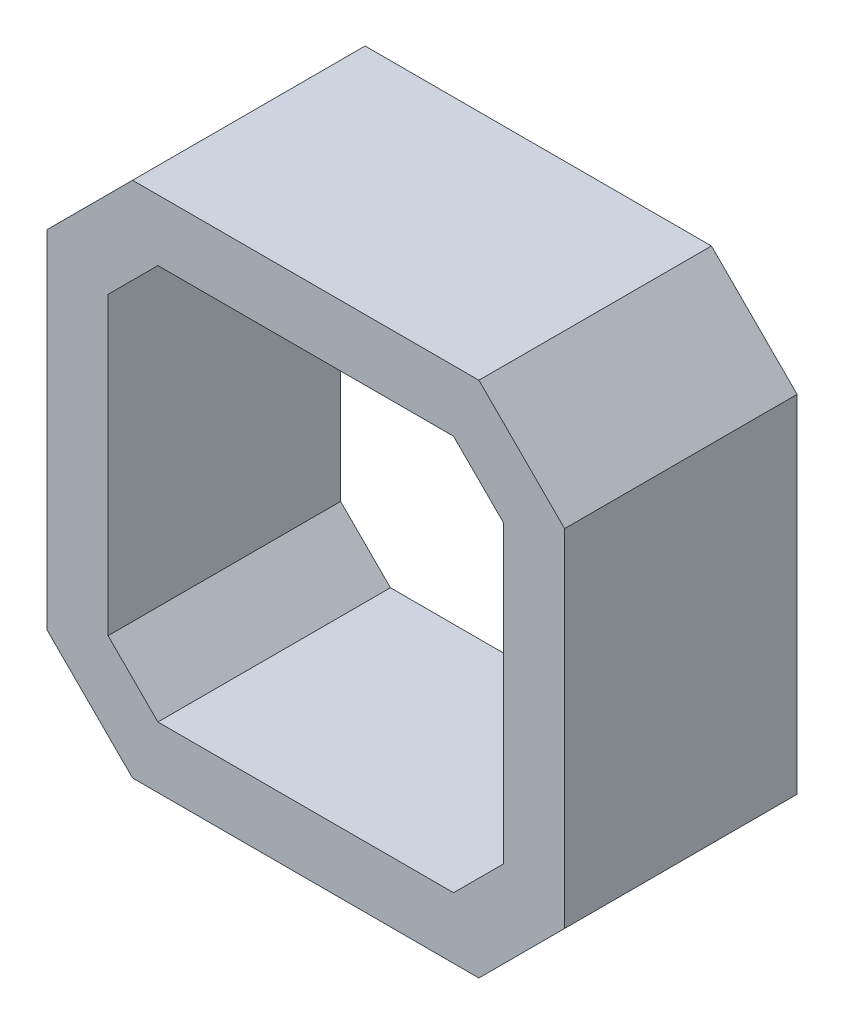
ISO-10303-21;
HEADER;
FILE_DESCRIPTION(('STEP AP214'),'2;1');
FILE_NAME('part.step','',(''),(''),'','','');
FILE_SCHEMA(('AUTOMOTIVE_DESIGN { 1 0 10303 214 1 1 1 1 }'));
ENDSEC;
DATA;
#1=APPLICATION_CONTEXT('core data for automotive mechanical design processes');
#2=APPLICATION_PROTOCOL_DEFINITION('international standard','automotive_design',2000,#1);
#3=PRODUCT_CONTEXT('',#1,'mechanical');
#4=PRODUCT('Part','Part','',(#3));
#5=PRODUCT_RELATED_PRODUCT_CATEGORY('part','',(#4));
#6=PRODUCT_DEFINITION_FORMATION('','',#4);
#7=PRODUCT_DEFINITION_CONTEXT('part definition',#1,'design');
#8=PRODUCT_DEFINITION('design','',#6,#7);
#9=PRODUCT_DEFINITION_SHAPE('','',#8);
#10=(LENGTH_UNIT() NAMED_UNIT(*) SI_UNIT(.MILLI.,.METRE.));
#11=(NAMED_UNIT(*) PLANE_ANGLE_UNIT() SI_UNIT($,.RADIAN.));
#12=(NAMED_UNIT(*) SI_UNIT($,.STERADIAN.) SOLID_ANGLE_UNIT());
#13=UNCERTAINTY_MEASURE_WITH_UNIT(LENGTH_MEASURE(1.E-05),#10,'distance_accuracy_value','');
#14=(GEOMETRIC_REPRESENTATION_CONTEXT(3) GLOBAL_UNCERTAINTY_ASSIGNED_CONTEXT((#13)) GLOBAL_UNIT_ASSIGNED_CONTEXT((#10,
#11,#12)) REPRESENTATION_CONTEXT('',''));
#15=CARTESIAN_POINT('',(0.,0.,0.));
#16=DIRECTION('',(0.,0.,1.));
#17=DIRECTION('',(1.,0.,0.));
#18=AXIS2_PLACEMENT_3D('',#15,#16,#17);
#19=CARTESIAN_POINT('',(0.,0.,19.));
#20=DIRECTION('',(0.,0.,-1.));
#21=DIRECTION('',(-1.,0.,0.));
#22=AXIS2_PLACEMENT_3D('',#19,#20,#21);
#23=PLANE('',#22);
#24=DIRECTION('',(0.,-1.,0.));
#25=VECTOR('',#24,1.);
#26=CARTESIAN_POINT('',(-21.15,-14.15,19.));
#27=LINE('',#26,#25);
#28=CARTESIAN_POINT('',(-21.15,14.15,19.));
#29=VERTEX_POINT('',#28);
#30=CARTESIAN_POINT('',(-21.15,-14.15,19.));
#31=VERTEX_POINT('',#30);
#32=EDGE_CURVE('E242',#29,#31,#27,.T.);
#33=ORIENTED_EDGE('',*,*,#32,.T.);
#34=DIRECTION('',(0.707106781186547,-0.707106781186547,0.));
#35=VECTOR('',#34,1.);
#36=CARTESIAN_POINT('',(-21.15,-14.15,19.));
#37=LINE('',#36,#35);
#38=CARTESIAN_POINT('',(-14.15,-21.15,19.));
#39=VERTEX_POINT('',#38);
#40=EDGE_CURVE('E246',#31,#39,#37,.T.);
#41=ORIENTED_EDGE('',*,*,#40,.T.);
#42=DIRECTION('',(1.,0.,0.));
#43=VECTOR('',#42,1.);
#44=CARTESIAN_POINT('',(-14.15,-21.15,19.));
#45=LINE('',#44,#43);
#46=CARTESIAN_POINT('',(14.15,-21.15,19.));
#47=VERTEX_POINT('',#46);
#48=EDGE_CURVE('E250',#39,#47,#45,.T.);
#49=ORIENTED_EDGE('',*,*,#48,.T.);
#50=DIRECTION('',(0.707106781186547,0.707106781186547,0.));
#51=VECTOR('',#50,1.);
#52=CARTESIAN_POINT('',(14.15,-21.15,19.));
#53=LINE('',#52,#51);
#54=CARTESIAN_POINT('',(21.15,-14.15,19.));
#55=VERTEX_POINT('',#54);
#56=EDGE_CURVE('E253',#47,#55,#53,.T.);
#57=ORIENTED_EDGE('',*,*,#56,.T.);
#58=DIRECTION('',(0.,1.,0.));
#59=VECTOR('',#58,1.);
#60=CARTESIAN_POINT('',(21.15,-14.15,19.));
#61=LINE('',#60,#59);
#62=CARTESIAN_POINT('',(21.15,14.15,19.));
#63=VERTEX_POINT('',#62);
#64=EDGE_CURVE('E256',#55,#63,#61,.T.);
#65=ORIENTED_EDGE('',*,*,#64,.T.);
#66=DIRECTION('',(-0.707106781186547,0.707106781186547,0.));
#67=VECTOR('',#66,1.);
#68=CARTESIAN_POINT('',(14.15,21.15,19.));
#69=LINE('',#68,#67);
#70=CARTESIAN_POINT('',(14.15,21.15,19.));
#71=VERTEX_POINT('',#70);
#72=EDGE_CURVE('E259',#63,#71,#69,.T.);
#73=ORIENTED_EDGE('',*,*,#72,.T.);
#74=DIRECTION('',(-1.,0.,0.));
#75=VECTOR('',#74,1.);
#76=CARTESIAN_POINT('',(-14.15,21.15,19.));
#77=LINE('',#76,#75);
#78=CARTESIAN_POINT('',(-14.15,21.15,19.));
#79=VERTEX_POINT('',#78);
#80=EDGE_CURVE('E262',#71,#79,#77,.T.);
#81=ORIENTED_EDGE('',*,*,#80,.T.);
#82=DIRECTION('',(-0.707106781186547,-0.707106781186547,0.));
#83=VECTOR('',#82,1.);
#84=CARTESIAN_POINT('',(-21.15,14.15,19.));
#85=LINE('',#84,#83);
#86=EDGE_CURVE('E265',#79,#29,#85,.T.);
#87=ORIENTED_EDGE('',*,*,#86,.T.);
#88=EDGE_LOOP('',(#33,#41,#49,#57,#65,#73,#81,#87));
#89=FACE_BOUND('',#88,.T.);
#90=DIRECTION('',(-0.707106781186547,-0.707106781186547,0.));
#91=VECTOR('',#90,1.);
#92=CARTESIAN_POINT('',(-16.15,12.0789321881345,19.));
#93=LINE('',#92,#91);
#94=CARTESIAN_POINT('',(-12.0789321881345,16.15,19.));
#95=VERTEX_POINT('',#94);
#96=CARTESIAN_POINT('',(-16.15,12.0789321881345,19.));
#97=VERTEX_POINT('',#96);
#98=EDGE_CURVE('E153',#95,#97,#93,.T.);
#99=ORIENTED_EDGE('',*,*,#98,.F.);
#100=DIRECTION('',(-1.,0.,0.));
#101=VECTOR('',#100,1.);
#102=CARTESIAN_POINT('',(-12.0789321881345,16.15,19.));
#103=LINE('',#102,#101);
#104=CARTESIAN_POINT('',(12.0789321881345,16.15,19.));
#105=VERTEX_POINT('',#104);
#106=EDGE_CURVE('E194',#105,#95,#103,.T.);
#107=ORIENTED_EDGE('',*,*,#106,.F.);
#108=DIRECTION('',(-0.707106781186547,0.707106781186547,0.));
#109=VECTOR('',#108,1.);
#110=CARTESIAN_POINT('',(12.0789321881345,16.15,19.));
#111=LINE('',#110,#109);
#112=CARTESIAN_POINT('',(16.15,12.0789321881345,19.));
#113=VERTEX_POINT('',#112);
#114=EDGE_CURVE('E191',#113,#105,#111,.T.);
#115=ORIENTED_EDGE('',*,*,#114,.F.);
#116=DIRECTION('',(0.,1.,0.));
#117=VECTOR('',#116,1.);
#118=CARTESIAN_POINT('',(16.15,-12.0789321881345,19.));
#119=LINE('',#118,#117);
#120=CARTESIAN_POINT('',(16.15,-12.0789321881345,19.));
#121=VERTEX_POINT('',#120);
#122=EDGE_CURVE('E188',#121,#113,#119,.T.);
#123=ORIENTED_EDGE('',*,*,#122,.F.);
#124=DIRECTION('',(0.707106781186547,0.707106781186547,0.));
#125=VECTOR('',#124,1.);
#126=CARTESIAN_POINT('',(12.0789321881345,-16.15,19.));
#127=LINE('',#126,#125);
#128=CARTESIAN_POINT('',(12.0789321881345,-16.15,19.));
#129=VERTEX_POINT('',#128);
#130=EDGE_CURVE('E185',#129,#121,#127,.T.);
#131=ORIENTED_EDGE('',*,*,#130,.F.);
#132=DIRECTION('',(1.,0.,0.));
#133=VECTOR('',#132,1.);
#134=CARTESIAN_POINT('',(-12.0789321881345,-16.15,19.));
#135=LINE('',#134,#133);
#136=CARTESIAN_POINT('',(-12.0789321881345,-16.15,19.));
#137=VERTEX_POINT('',#136);
#138=EDGE_CURVE('E180',#137,#129,#135,.T.);
#139=ORIENTED_EDGE('',*,*,#138,.F.);
#140=DIRECTION('',(0.707106781186547,-0.707106781186547,0.));
#141=VECTOR('',#140,1.);
#142=CARTESIAN_POINT('',(-16.15,-12.0789321881345,19.));
#143=LINE('',#142,#141);
#144=CARTESIAN_POINT('',(-16.15,-12.0789321881345,19.));
#145=VERTEX_POINT('',#144);
#146=EDGE_CURVE('E176',#145,#137,#143,.T.);
#147=ORIENTED_EDGE('',*,*,#146,.F.);
#148=DIRECTION('',(0.,-1.,0.));
#149=VECTOR('',#148,1.);
#150=CARTESIAN_POINT('',(-16.15,-12.0789321881345,19.));
#151=LINE('',#150,#149);
#152=EDGE_CURVE('E162',#97,#145,#151,.T.);
#153=ORIENTED_EDGE('',*,*,#152,.F.);
#154=EDGE_LOOP('',(#99,#107,#115,#123,#131,#139,#147,#153));
#155=FACE_BOUND('',#154,.T.);
#156=ADVANCED_FACE('F39',(#89,#155),#23,.F.);
#157=CARTESIAN_POINT('',(0.,0.,0.));
#158=DIRECTION('',(0.,0.,-1.));
#159=DIRECTION('',(-1.,0.,0.));
#160=AXIS2_PLACEMENT_3D('',#157,#158,#159);
#161=PLANE('',#160);
#162=DIRECTION('',(0.,-1.,0.));
#163=VECTOR('',#162,1.);
#164=CARTESIAN_POINT('',(-21.15,-14.15,0.));
#165=LINE('',#164,#163);
#166=CARTESIAN_POINT('',(-21.15,14.15,0.));
#167=VERTEX_POINT('',#166);
#168=CARTESIAN_POINT('',(-21.15,-14.15,0.));
#169=VERTEX_POINT('',#168);
#170=EDGE_CURVE('E171',#167,#169,#165,.T.);
#171=ORIENTED_EDGE('',*,*,#170,.F.);
#172=DIRECTION('',(-0.707106781186547,-0.707106781186547,0.));
#173=VECTOR('',#172,1.);
#174=CARTESIAN_POINT('',(-21.15,14.15,0.));
#175=LINE('',#174,#173);
#176=CARTESIAN_POINT('',(-14.15,21.15,0.));
#177=VERTEX_POINT('',#176);
#178=EDGE_CURVE('E247',#177,#167,#175,.T.);
#179=ORIENTED_EDGE('',*,*,#178,.F.);
#180=DIRECTION('',(-1.,0.,0.));
#181=VECTOR('',#180,1.);
#182=CARTESIAN_POINT('',(-14.15,21.15,0.));
#183=LINE('',#182,#181);
#184=CARTESIAN_POINT('',(14.15,21.15,0.));
#185=VERTEX_POINT('',#184);
#186=EDGE_CURVE('E287',#185,#177,#183,.T.);
#187=ORIENTED_EDGE('',*,*,#186,.F.);
#188=DIRECTION('',(-0.707106781186547,0.707106781186547,0.));
#189=VECTOR('',#188,1.);
#190=CARTESIAN_POINT('',(14.15,21.15,0.));
#191=LINE('',#190,#189);
#192=CARTESIAN_POINT('',(21.15,14.15,0.));
#193=VERTEX_POINT('',#192);
#194=EDGE_CURVE('E284',#193,#185,#191,.T.);
#195=ORIENTED_EDGE('',*,*,#194,.F.);
#196=DIRECTION('',(0.,1.,0.));
#197=VECTOR('',#196,1.);
#198=CARTESIAN_POINT('',(21.15,-14.15,0.));
#199=LINE('',#198,#197);
#200=CARTESIAN_POINT('',(21.15,-14.15,0.));
#201=VERTEX_POINT('',#200);
#202=EDGE_CURVE('E281',#201,#193,#199,.T.);
#203=ORIENTED_EDGE('',*,*,#202,.F.);
#204=DIRECTION('',(0.707106781186547,0.707106781186547,0.));
#205=VECTOR('',#204,1.);
#206=CARTESIAN_POINT('',(14.15,-21.15,0.));
#207=LINE('',#206,#205);
#208=CARTESIAN_POINT('',(14.15,-21.15,0.));
#209=VERTEX_POINT('',#208);
#210=EDGE_CURVE('E278',#209,#201,#207,.T.);
#211=ORIENTED_EDGE('',*,*,#210,.F.);
#212=DIRECTION('',(1.,0.,0.));
#213=VECTOR('',#212,1.);
#214=CARTESIAN_POINT('',(-14.15,-21.15,0.));
#215=LINE('',#214,#213);
#216=CARTESIAN_POINT('',(-14.15,-21.15,0.));
#217=VERTEX_POINT('',#216);
#218=EDGE_CURVE('E275',#217,#209,#215,.T.);
#219=ORIENTED_EDGE('',*,*,#218,.F.);
#220=DIRECTION('',(0.707106781186547,-0.707106781186547,0.));
#221=VECTOR('',#220,1.);
#222=CARTESIAN_POINT('',(-21.15,-14.15,0.));
#223=LINE('',#222,#221);
#224=EDGE_CURVE('E272',#169,#217,#223,.T.);
#225=ORIENTED_EDGE('',*,*,#224,.F.);
#226=EDGE_LOOP('',(#171,#179,#187,#195,#203,#211,#219,#225));
#227=FACE_BOUND('',#226,.T.);
#228=DIRECTION('',(-1.,0.,0.));
#229=VECTOR('',#228,1.);
#230=CARTESIAN_POINT('',(-12.0789321881345,16.15,0.));
#231=LINE('',#230,#229);
#232=CARTESIAN_POINT('',(12.0789321881345,16.15,0.));
#233=VERTEX_POINT('',#232);
#234=CARTESIAN_POINT('',(-12.0789321881345,16.15,0.));
#235=VERTEX_POINT('',#234);
#236=EDGE_CURVE('E163',#233,#235,#231,.T.);
#237=ORIENTED_EDGE('',*,*,#236,.T.);
#238=DIRECTION('',(-0.707106781186547,-0.707106781186547,0.));
#239=VECTOR('',#238,1.);
#240=CARTESIAN_POINT('',(-16.15,12.0789321881345,0.));
#241=LINE('',#240,#239);
#242=CARTESIAN_POINT('',(-16.15,12.0789321881345,0.));
#243=VERTEX_POINT('',#242);
#244=EDGE_CURVE('E63',#235,#243,#241,.T.);
#245=ORIENTED_EDGE('',*,*,#244,.T.);
#246=DIRECTION('',(0.,-1.,0.));
#247=VECTOR('',#246,1.);
#248=CARTESIAN_POINT('',(-16.15,-12.0789321881345,0.));
#249=LINE('',#248,#247);
#250=CARTESIAN_POINT('',(-16.15,-12.0789321881345,0.));
#251=VERTEX_POINT('',#250);
#252=EDGE_CURVE('E169',#243,#251,#249,.T.);
#253=ORIENTED_EDGE('',*,*,#252,.T.);
#254=DIRECTION('',(0.707106781186547,-0.707106781186547,0.));
#255=VECTOR('',#254,1.);
#256=CARTESIAN_POINT('',(-16.15,-12.0789321881345,0.));
#257=LINE('',#256,#255);
#258=CARTESIAN_POINT('',(-12.0789321881345,-16.15,0.));
#259=VERTEX_POINT('',#258);
#260=EDGE_CURVE('E201',#251,#259,#257,.T.);
#261=ORIENTED_EDGE('',*,*,#260,.T.);
#262=DIRECTION('',(1.,0.,0.));
#263=VECTOR('',#262,1.);
#264=CARTESIAN_POINT('',(-12.0789321881345,-16.15,0.));
#265=LINE('',#264,#263);
#266=CARTESIAN_POINT('',(12.0789321881345,-16.15,0.));
#267=VERTEX_POINT('',#266);
#268=EDGE_CURVE('E205',#259,#267,#265,.T.);
#269=ORIENTED_EDGE('',*,*,#268,.T.);
#270=DIRECTION('',(0.707106781186547,0.707106781186547,0.));
#271=VECTOR('',#270,1.);
#272=CARTESIAN_POINT('',(12.0789321881345,-16.15,0.));
#273=LINE('',#272,#271);
#274=CARTESIAN_POINT('',(16.15,-12.0789321881345,0.));
#275=VERTEX_POINT('',#274);
#276=EDGE_CURVE('E209',#267,#275,#273,.T.);
#277=ORIENTED_EDGE('',*,*,#276,.T.);
#278=DIRECTION('',(0.,1.,0.));
#279=VECTOR('',#278,1.);
#280=CARTESIAN_POINT('',(16.15,-12.0789321881345,0.));
#281=LINE('',#280,#279);
#282=CARTESIAN_POINT('',(16.15,12.0789321881345,0.));
#283=VERTEX_POINT('',#282);
#284=EDGE_CURVE('E213',#275,#283,#281,.T.);
#285=ORIENTED_EDGE('',*,*,#284,.T.);
#286=DIRECTION('',(-0.707106781186547,0.707106781186547,0.));
#287=VECTOR('',#286,1.);
#288=CARTESIAN_POINT('',(12.0789321881345,16.15,0.));
#289=LINE('',#288,#287);
#290=EDGE_CURVE('E217',#283,#233,#289,.T.);
#291=ORIENTED_EDGE('',*,*,#290,.T.);
#292=EDGE_LOOP('',(#237,#245,#253,#261,#269,#277,#285,#291));
#293=FACE_BOUND('',#292,.T.);
#294=ADVANCED_FACE('F326',(#227,#293),#161,.T.);
#295=CARTESIAN_POINT('',(-21.15,-14.15,19.));
#296=DIRECTION('',(1.,0.,0.));
#297=DIRECTION('',(0.,0.,-1.));
#298=AXIS2_PLACEMENT_3D('',#295,#296,#297);
#299=PLANE('',#298);
#300=ORIENTED_EDGE('',*,*,#170,.T.);
#301=DIRECTION('',(0.,0.,-1.));
#302=VECTOR('',#301,1.);
#303=CARTESIAN_POINT('',(-21.15,-14.15,19.));
#304=LINE('',#303,#302);
#305=EDGE_CURVE('E11',#31,#169,#304,.T.);
#306=ORIENTED_EDGE('',*,*,#305,.F.);
#307=ORIENTED_EDGE('',*,*,#32,.F.);
#308=DIRECTION('',(0.,0.,-1.));
#309=VECTOR('',#308,1.);
#310=CARTESIAN_POINT('',(-21.15,14.15,19.));
#311=LINE('',#310,#309);
#312=EDGE_CURVE('E268',#29,#167,#311,.T.);
#313=ORIENTED_EDGE('',*,*,#312,.T.);
#314=EDGE_LOOP('',(#300,#306,#307,#313));
#315=FACE_BOUND('',#314,.T.);
#316=ADVANCED_FACE('F41',(#315),#299,.F.);
#317=CARTESIAN_POINT('',(-21.15,-14.15,19.));
#318=DIRECTION('',(0.707106781186548,0.707106781186548,0.));
#319=DIRECTION('',(-0.707106781186548,0.707106781186548,0.));
#320=AXIS2_PLACEMENT_3D('',#317,#318,#319);
#321=PLANE('',#320);
#322=ORIENTED_EDGE('',*,*,#224,.T.);
#323=DIRECTION('',(0.,0.,-1.));
#324=VECTOR('',#323,1.);
#325=CARTESIAN_POINT('',(-14.15,-21.15,19.));
#326=LINE('',#325,#324);
#327=EDGE_CURVE('E48',#39,#217,#326,.T.);
#328=ORIENTED_EDGE('',*,*,#327,.F.);
#329=ORIENTED_EDGE('',*,*,#40,.F.);
#330=ORIENTED_EDGE('',*,*,#305,.T.);
#331=EDGE_LOOP('',(#322,#328,#329,#330));
#332=FACE_BOUND('',#331,.T.);
#333=ADVANCED_FACE('F343',(#332),#321,.F.);
#334=CARTESIAN_POINT('',(-14.15,-21.15,19.));
#335=DIRECTION('',(0.,1.,0.));
#336=DIRECTION('',(0.,0.,1.));
#337=AXIS2_PLACEMENT_3D('',#334,#335,#336);
#338=PLANE('',#337);
#339=ORIENTED_EDGE('',*,*,#218,.T.);
#340=DIRECTION('',(0.,0.,-1.));
#341=VECTOR('',#340,1.);
#342=CARTESIAN_POINT('',(14.15,-21.15,19.));
#343=LINE('',#342,#341);
#344=EDGE_CURVE('E311',#47,#209,#343,.T.);
#345=ORIENTED_EDGE('',*,*,#344,.F.);
#346=ORIENTED_EDGE('',*,*,#48,.F.);
#347=ORIENTED_EDGE('',*,*,#327,.T.);
#348=EDGE_LOOP('',(#339,#345,#346,#347));
#349=FACE_BOUND('',#348,.T.);
#350=ADVANCED_FACE('F320',(#349),#338,.F.);
#351=CARTESIAN_POINT('',(14.15,-21.15,19.));
#352=DIRECTION('',(-0.707106781186548,0.707106781186548,0.));
#353=DIRECTION('',(-0.707106781186548,-0.707106781186548,0.));
#354=AXIS2_PLACEMENT_3D('',#351,#352,#353);
#355=PLANE('',#354);
#356=ORIENTED_EDGE('',*,*,#210,.T.);
#357=DIRECTION('',(0.,0.,-1.));
#358=VECTOR('',#357,1.);
#359=CARTESIAN_POINT('',(21.15,-14.15,19.));
#360=LINE('',#359,#358);
#361=EDGE_CURVE('E307',#55,#201,#360,.T.);
#362=ORIENTED_EDGE('',*,*,#361,.F.);
#363=ORIENTED_EDGE('',*,*,#56,.F.);
#364=ORIENTED_EDGE('',*,*,#344,.T.);
#365=EDGE_LOOP('',(#356,#362,#363,#364));
#366=FACE_BOUND('',#365,.T.);
#367=ADVANCED_FACE('F332',(#366),#355,.F.);
#368=CARTESIAN_POINT('',(21.15,-14.15,19.));
#369=DIRECTION('',(-1.,0.,0.));
#370=DIRECTION('',(0.,0.,1.));
#371=AXIS2_PLACEMENT_3D('',#368,#369,#370);
#372=PLANE('',#371);
#373=ORIENTED_EDGE('',*,*,#202,.T.);
#374=DIRECTION('',(0.,0.,-1.));
#375=VECTOR('',#374,1.);
#376=CARTESIAN_POINT('',(21.15,14.15,19.));
#377=LINE('',#376,#375);
#378=EDGE_CURVE('E303',#63,#193,#377,.T.);
#379=ORIENTED_EDGE('',*,*,#378,.F.);
#380=ORIENTED_EDGE('',*,*,#64,.F.);
#381=ORIENTED_EDGE('',*,*,#361,.T.);
#382=EDGE_LOOP('',(#373,#379,#380,#381));
#383=FACE_BOUND('',#382,.T.);
#384=ADVANCED_FACE('F336',(#383),#372,.F.);
#385=CARTESIAN_POINT('',(14.15,21.15,19.));
#386=DIRECTION('',(-0.707106781186548,-0.707106781186548,0.));
#387=DIRECTION('',(0.707106781186548,-0.707106781186548,0.));
#388=AXIS2_PLACEMENT_3D('',#385,#386,#387);
#389=PLANE('',#388);
#390=ORIENTED_EDGE('',*,*,#194,.T.);
#391=DIRECTION('',(0.,0.,-1.));
#392=VECTOR('',#391,1.);
#393=CARTESIAN_POINT('',(14.15,21.15,19.));
#394=LINE('',#393,#392);
#395=EDGE_CURVE('E299',#71,#185,#394,.T.);
#396=ORIENTED_EDGE('',*,*,#395,.F.);
#397=ORIENTED_EDGE('',*,*,#72,.F.);
#398=ORIENTED_EDGE('',*,*,#378,.T.);
#399=EDGE_LOOP('',(#390,#396,#397,#398));
#400=FACE_BOUND('',#399,.T.);
#401=ADVANCED_FACE('F356',(#400),#389,.F.);
#402=CARTESIAN_POINT('',(-14.15,21.15,19.));
#403=DIRECTION('',(0.,-1.,0.));
#404=DIRECTION('',(0.,0.,-1.));
#405=AXIS2_PLACEMENT_3D('',#402,#403,#404);
#406=PLANE('',#405);
#407=ORIENTED_EDGE('',*,*,#186,.T.);
#408=DIRECTION('',(0.,0.,-1.));
#409=VECTOR('',#408,1.);
#410=CARTESIAN_POINT('',(-14.15,21.15,19.));
#411=LINE('',#410,#409);
#412=EDGE_CURVE('E295',#79,#177,#411,.T.);
#413=ORIENTED_EDGE('',*,*,#412,.F.);
#414=ORIENTED_EDGE('',*,*,#80,.F.);
#415=ORIENTED_EDGE('',*,*,#395,.T.);
#416=EDGE_LOOP('',(#407,#413,#414,#415));
#417=FACE_BOUND('',#416,.T.);
#418=ADVANCED_FACE('F354',(#417),#406,.F.);
#419=CARTESIAN_POINT('',(-21.15,14.15,19.));
#420=DIRECTION('',(0.707106781186548,-0.707106781186548,0.));
#421=DIRECTION('',(0.707106781186548,0.707106781186548,0.));
#422=AXIS2_PLACEMENT_3D('',#419,#420,#421);
#423=PLANE('',#422);
#424=ORIENTED_EDGE('',*,*,#178,.T.);
#425=ORIENTED_EDGE('',*,*,#312,.F.);
#426=ORIENTED_EDGE('',*,*,#86,.F.);
#427=ORIENTED_EDGE('',*,*,#412,.T.);
#428=EDGE_LOOP('',(#424,#425,#426,#427));
#429=FACE_BOUND('',#428,.T.);
#430=ADVANCED_FACE('F349',(#429),#423,.F.);
#431=CARTESIAN_POINT('',(-16.15,12.0789321881345,19.));
#432=DIRECTION('',(0.707106781186548,-0.707106781186548,0.));
#433=DIRECTION('',(0.707106781186548,0.707106781186548,0.));
#434=AXIS2_PLACEMENT_3D('',#431,#432,#433);
#435=PLANE('',#434);
#436=ORIENTED_EDGE('',*,*,#244,.F.);
#437=DIRECTION('',(0.,0.,-1.));
#438=VECTOR('',#437,1.);
#439=CARTESIAN_POINT('',(-12.0789321881345,16.15,19.));
#440=LINE('',#439,#438);
#441=EDGE_CURVE('E157',#95,#235,#440,.T.);
#442=ORIENTED_EDGE('',*,*,#441,.F.);
#443=ORIENTED_EDGE('',*,*,#98,.T.);
#444=DIRECTION('',(0.,0.,-1.));
#445=VECTOR('',#444,1.);
#446=CARTESIAN_POINT('',(-16.15,12.0789321881345,19.));
#447=LINE('',#446,#445);
#448=EDGE_CURVE('E156',#97,#243,#447,.T.);
#449=ORIENTED_EDGE('',*,*,#448,.T.);
#450=EDGE_LOOP('',(#436,#442,#443,#449));
#451=FACE_BOUND('',#450,.T.);
#452=ADVANCED_FACE('F155',(#451),#435,.T.);
#453=CARTESIAN_POINT('',(-16.15,-12.0789321881345,19.));
#454=DIRECTION('',(1.,0.,0.));
#455=DIRECTION('',(0.,0.,-1.));
#456=AXIS2_PLACEMENT_3D('',#453,#454,#455);
#457=PLANE('',#456);
#458=ORIENTED_EDGE('',*,*,#252,.F.);
#459=ORIENTED_EDGE('',*,*,#448,.F.);
#460=ORIENTED_EDGE('',*,*,#152,.T.);
#461=DIRECTION('',(0.,0.,-1.));
#462=VECTOR('',#461,1.);
#463=CARTESIAN_POINT('',(-16.15,-12.0789321881345,19.));
#464=LINE('',#463,#462);
#465=EDGE_CURVE('E172',#145,#251,#464,.T.);
#466=ORIENTED_EDGE('',*,*,#465,.T.);
#467=EDGE_LOOP('',(#458,#459,#460,#466));
#468=FACE_BOUND('',#467,.T.);
#469=ADVANCED_FACE('F166',(#468),#457,.T.);
#470=CARTESIAN_POINT('',(-16.15,-12.0789321881345,19.));
#471=DIRECTION('',(0.707106781186548,0.707106781186548,0.));
#472=DIRECTION('',(-0.707106781186548,0.707106781186548,0.));
#473=AXIS2_PLACEMENT_3D('',#470,#471,#472);
#474=PLANE('',#473);
#475=ORIENTED_EDGE('',*,*,#260,.F.);
#476=ORIENTED_EDGE('',*,*,#465,.F.);
#477=ORIENTED_EDGE('',*,*,#146,.T.);
#478=DIRECTION('',(0.,0.,-1.));
#479=VECTOR('',#478,1.);
#480=CARTESIAN_POINT('',(-12.0789321881345,-16.15,19.));
#481=LINE('',#480,#479);
#482=EDGE_CURVE('E237',#137,#259,#481,.T.);
#483=ORIENTED_EDGE('',*,*,#482,.T.);
#484=EDGE_LOOP('',(#475,#476,#477,#483));
#485=FACE_BOUND('',#484,.T.);
#486=ADVANCED_FACE('F381',(#485),#474,.T.);
#487=CARTESIAN_POINT('',(-12.0789321881345,-16.15,19.));
#488=DIRECTION('',(0.,1.,0.));
#489=DIRECTION('',(0.,0.,1.));
#490=AXIS2_PLACEMENT_3D('',#487,#488,#489);
#491=PLANE('',#490);
#492=ORIENTED_EDGE('',*,*,#268,.F.);
#493=ORIENTED_EDGE('',*,*,#482,.F.);
#494=ORIENTED_EDGE('',*,*,#138,.T.);
#495=DIRECTION('',(0.,0.,-1.));
#496=VECTOR('',#495,1.);
#497=CARTESIAN_POINT('',(12.0789321881345,-16.15,19.));
#498=LINE('',#497,#496);
#499=EDGE_CURVE('E234',#129,#267,#498,.T.);
#500=ORIENTED_EDGE('',*,*,#499,.T.);
#501=EDGE_LOOP('',(#492,#493,#494,#500));
#502=FACE_BOUND('',#501,.T.);
#503=ADVANCED_FACE('F385',(#502),#491,.T.);
#504=CARTESIAN_POINT('',(12.0789321881345,-16.15,19.));
#505=DIRECTION('',(-0.707106781186548,0.707106781186548,0.));
#506=DIRECTION('',(-0.707106781186548,-0.707106781186548,0.));
#507=AXIS2_PLACEMENT_3D('',#504,#505,#506);
#508=PLANE('',#507);
#509=ORIENTED_EDGE('',*,*,#276,.F.);
#510=ORIENTED_EDGE('',*,*,#499,.F.);
#511=ORIENTED_EDGE('',*,*,#130,.T.);
#512=DIRECTION('',(0.,0.,-1.));
#513=VECTOR('',#512,1.);
#514=CARTESIAN_POINT('',(16.15,-12.0789321881345,19.));
#515=LINE('',#514,#513);
#516=EDGE_CURVE('E231',#121,#275,#515,.T.);
#517=ORIENTED_EDGE('',*,*,#516,.T.);
#518=EDGE_LOOP('',(#509,#510,#511,#517));
#519=FACE_BOUND('',#518,.T.);
#520=ADVANCED_FACE('F391',(#519),#508,.T.);
#521=CARTESIAN_POINT('',(16.15,-12.0789321881345,19.));
#522=DIRECTION('',(-1.,0.,0.));
#523=DIRECTION('',(0.,0.,1.));
#524=AXIS2_PLACEMENT_3D('',#521,#522,#523);
#525=PLANE('',#524);
#526=ORIENTED_EDGE('',*,*,#284,.F.);
#527=ORIENTED_EDGE('',*,*,#516,.F.);
#528=ORIENTED_EDGE('',*,*,#122,.T.);
#529=DIRECTION('',(0.,0.,-1.));
#530=VECTOR('',#529,1.);
#531=CARTESIAN_POINT('',(16.15,12.0789321881345,19.));
#532=LINE('',#531,#530);
#533=EDGE_CURVE('E228',#113,#283,#532,.T.);
#534=ORIENTED_EDGE('',*,*,#533,.T.);
#535=EDGE_LOOP('',(#526,#527,#528,#534));
#536=FACE_BOUND('',#535,.T.);
#537=ADVANCED_FACE('F395',(#536),#525,.T.);
#538=CARTESIAN_POINT('',(12.0789321881345,16.15,19.));
#539=DIRECTION('',(-0.707106781186548,-0.707106781186548,0.));
#540=DIRECTION('',(0.707106781186548,-0.707106781186548,0.));
#541=AXIS2_PLACEMENT_3D('',#538,#539,#540);
#542=PLANE('',#541);
#543=ORIENTED_EDGE('',*,*,#290,.F.);
#544=ORIENTED_EDGE('',*,*,#533,.F.);
#545=ORIENTED_EDGE('',*,*,#114,.T.);
#546=DIRECTION('',(0.,0.,-1.));
#547=VECTOR('',#546,1.);
#548=CARTESIAN_POINT('',(12.0789321881345,16.15,19.));
#549=LINE('',#548,#547);
#550=EDGE_CURVE('E55',#105,#233,#549,.T.);
#551=ORIENTED_EDGE('',*,*,#550,.T.);
#552=EDGE_LOOP('',(#543,#544,#545,#551));
#553=FACE_BOUND('',#552,.T.);
#554=ADVANCED_FACE('F399',(#553),#542,.T.);
#555=CARTESIAN_POINT('',(-12.0789321881345,16.15,19.));
#556=DIRECTION('',(0.,-1.,0.));
#557=DIRECTION('',(0.,0.,-1.));
#558=AXIS2_PLACEMENT_3D('',#555,#556,#557);
#559=PLANE('',#558);
#560=ORIENTED_EDGE('',*,*,#236,.F.);
#561=ORIENTED_EDGE('',*,*,#550,.F.);
#562=ORIENTED_EDGE('',*,*,#106,.T.);
#563=ORIENTED_EDGE('',*,*,#441,.T.);
#564=EDGE_LOOP('',(#560,#561,#562,#563));
#565=FACE_BOUND('',#564,.T.);
#566=ADVANCED_FACE('F403',(#565),#559,.T.);
#567=CLOSED_SHELL('',(#156,#294,#316,#333,#350,#367,#384,#401,#418,#430,#452,#469,#486,#503,
#520,#537,#554,#566));
#568=MANIFOLD_SOLID_BREP('B2',#567);
#569=ADVANCED_BREP_SHAPE_REPRESENTATION('',(#18,#568),#14);
#570=SHAPE_DEFINITION_REPRESENTATION(#9,#569);
ENDSEC;
END-ISO-10303-21;
